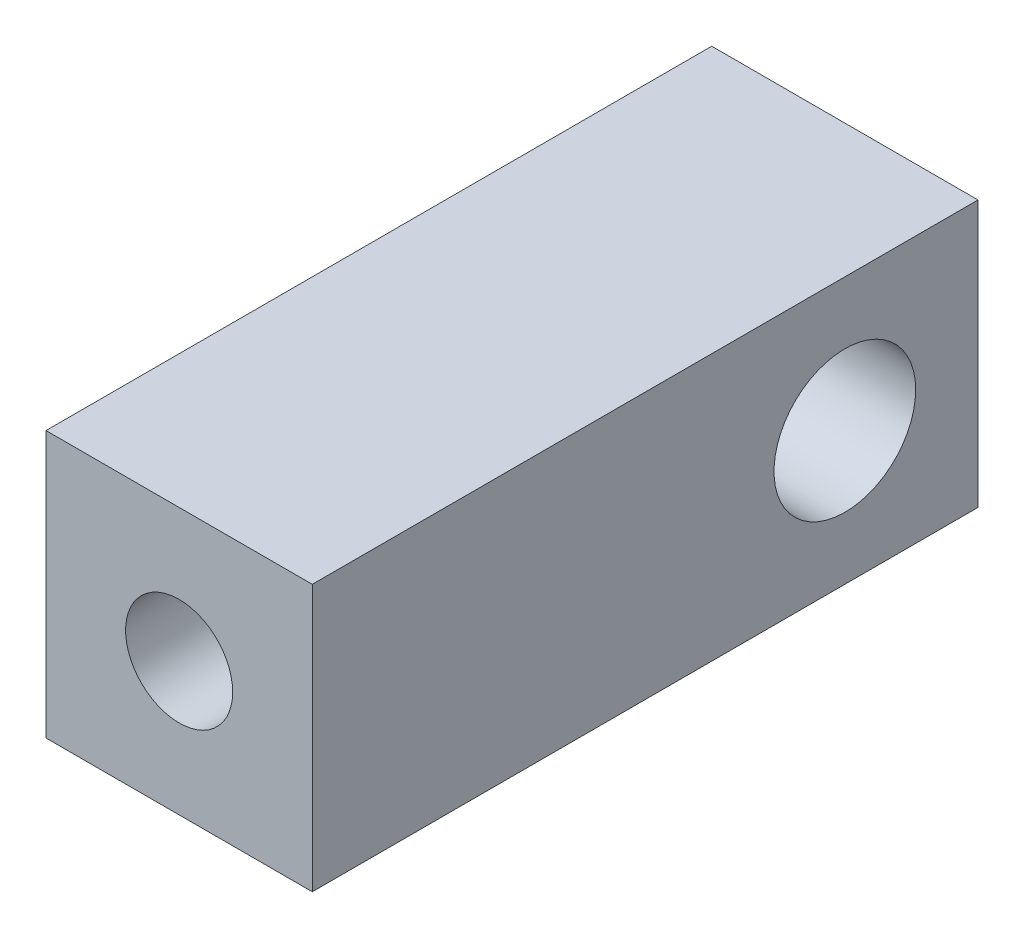
ISO-10303-21;
HEADER;
FILE_DESCRIPTION(('STEP AP214'),'2;1');
FILE_NAME('part.step','',(''),(''),'','','');
FILE_SCHEMA(('AUTOMOTIVE_DESIGN { 1 0 10303 214 1 1 1 1 }'));
ENDSEC;
DATA;
#1=APPLICATION_CONTEXT('core data for automotive mechanical design processes');
#2=APPLICATION_PROTOCOL_DEFINITION('international standard','automotive_design',2000,#1);
#3=PRODUCT_CONTEXT('',#1,'mechanical');
#4=PRODUCT('Part','Part','',(#3));
#5=PRODUCT_RELATED_PRODUCT_CATEGORY('part','',(#4));
#6=PRODUCT_DEFINITION_FORMATION('','',#4);
#7=PRODUCT_DEFINITION_CONTEXT('part definition',#1,'design');
#8=PRODUCT_DEFINITION('design','',#6,#7);
#9=PRODUCT_DEFINITION_SHAPE('','',#8);
#10=(LENGTH_UNIT() NAMED_UNIT(*) SI_UNIT(.MILLI.,.METRE.));
#11=(NAMED_UNIT(*) PLANE_ANGLE_UNIT() SI_UNIT($,.RADIAN.));
#12=(NAMED_UNIT(*) SI_UNIT($,.STERADIAN.) SOLID_ANGLE_UNIT());
#13=UNCERTAINTY_MEASURE_WITH_UNIT(LENGTH_MEASURE(1.E-05),#10,'distance_accuracy_value','');
#14=(GEOMETRIC_REPRESENTATION_CONTEXT(3) GLOBAL_UNCERTAINTY_ASSIGNED_CONTEXT((#13)) GLOBAL_UNIT_ASSIGNED_CONTEXT((#10,
#11,#12)) REPRESENTATION_CONTEXT('',''));
#15=CARTESIAN_POINT('',(0.,0.,0.));
#16=DIRECTION('',(0.,0.,1.));
#17=DIRECTION('',(1.,0.,0.));
#18=AXIS2_PLACEMENT_3D('',#15,#16,#17);
#19=CARTESIAN_POINT('',(12.7,0.,0.));
#20=DIRECTION('',(0.,0.,-1.));
#21=DIRECTION('',(-1.,0.,0.));
#22=AXIS2_PLACEMENT_3D('',#19,#20,#21);
#23=PLANE('',#22);
#24=CARTESIAN_POINT('',(6.35,6.35,0.));
#25=DIRECTION('',(0.,0.,1.));
#26=DIRECTION('',(1.,0.,0.));
#27=AXIS2_PLACEMENT_3D('',#24,#25,#26);
#28=CIRCLE('',#27,2.55269999999999);
#29=CARTESIAN_POINT('',(8.90269999999999,6.35,0.));
#30=VERTEX_POINT('',#29);
#31=EDGE_CURVE('E100',#30,#30,#28,.T.);
#32=ORIENTED_EDGE('',*,*,#31,.F.);
#33=EDGE_LOOP('',(#32));
#34=FACE_BOUND('',#33,.T.);
#35=DIRECTION('',(0.,-1.,0.));
#36=VECTOR('',#35,1.);
#37=CARTESIAN_POINT('',(0.,0.,0.));
#38=LINE('',#37,#36);
#39=CARTESIAN_POINT('',(0.,12.7,0.));
#40=VERTEX_POINT('',#39);
#41=CARTESIAN_POINT('',(0.,0.,0.));
#42=VERTEX_POINT('',#41);
#43=EDGE_CURVE('E99',#40,#42,#38,.T.);
#44=ORIENTED_EDGE('',*,*,#43,.T.);
#45=DIRECTION('',(-1.,0.,0.));
#46=VECTOR('',#45,1.);
#47=CARTESIAN_POINT('',(12.7,0.,0.));
#48=LINE('',#47,#46);
#49=CARTESIAN_POINT('',(12.7,0.,0.));
#50=VERTEX_POINT('',#49);
#51=EDGE_CURVE('E11',#50,#42,#48,.T.);
#52=ORIENTED_EDGE('',*,*,#51,.F.);
#53=DIRECTION('',(0.,-1.,0.));
#54=VECTOR('',#53,1.);
#55=CARTESIAN_POINT('',(12.7,0.,0.));
#56=LINE('',#55,#54);
#57=CARTESIAN_POINT('',(12.7,12.7,0.));
#58=VERTEX_POINT('',#57);
#59=EDGE_CURVE('E110',#58,#50,#56,.T.);
#60=ORIENTED_EDGE('',*,*,#59,.F.);
#61=DIRECTION('',(-1.,0.,0.));
#62=VECTOR('',#61,1.);
#63=CARTESIAN_POINT('',(12.7,12.7,0.));
#64=LINE('',#63,#62);
#65=EDGE_CURVE('E115',#58,#40,#64,.T.);
#66=ORIENTED_EDGE('',*,*,#65,.T.);
#67=EDGE_LOOP('',(#44,#52,#60,#66));
#68=FACE_BOUND('',#67,.T.);
#69=ADVANCED_FACE('F38',(#34,#68),#23,.F.);
#70=CARTESIAN_POINT('',(12.7,0.,0.));
#71=DIRECTION('',(0.,1.,0.));
#72=DIRECTION('',(0.,0.,1.));
#73=AXIS2_PLACEMENT_3D('',#70,#71,#72);
#74=PLANE('',#73);
#75=DIRECTION('',(0.,0.,-1.));
#76=VECTOR('',#75,1.);
#77=CARTESIAN_POINT('',(0.,0.,0.));
#78=LINE('',#77,#76);
#79=CARTESIAN_POINT('',(0.,0.,-31.75));
#80=VERTEX_POINT('',#79);
#81=EDGE_CURVE('E103',#42,#80,#78,.T.);
#82=ORIENTED_EDGE('',*,*,#81,.T.);
#83=DIRECTION('',(-1.,0.,0.));
#84=VECTOR('',#83,1.);
#85=CARTESIAN_POINT('',(12.7,0.,-31.75));
#86=LINE('',#85,#84);
#87=CARTESIAN_POINT('',(12.7,0.,-31.75));
#88=VERTEX_POINT('',#87);
#89=EDGE_CURVE('E46',#88,#80,#86,.T.);
#90=ORIENTED_EDGE('',*,*,#89,.F.);
#91=DIRECTION('',(0.,0.,-1.));
#92=VECTOR('',#91,1.);
#93=CARTESIAN_POINT('',(12.7,0.,0.));
#94=LINE('',#93,#92);
#95=EDGE_CURVE('E85',#50,#88,#94,.T.);
#96=ORIENTED_EDGE('',*,*,#95,.F.);
#97=ORIENTED_EDGE('',*,*,#51,.T.);
#98=EDGE_LOOP('',(#82,#90,#96,#97));
#99=FACE_BOUND('',#98,.T.);
#100=ADVANCED_FACE('F139',(#99),#74,.F.);
#101=CARTESIAN_POINT('',(12.7,0.,-31.75));
#102=DIRECTION('',(0.,0.,1.));
#103=DIRECTION('',(1.,0.,0.));
#104=AXIS2_PLACEMENT_3D('',#101,#102,#103);
#105=PLANE('',#104);
#106=DIRECTION('',(0.,1.,0.));
#107=VECTOR('',#106,1.);
#108=CARTESIAN_POINT('',(0.,0.,-31.75));
#109=LINE('',#108,#107);
#110=CARTESIAN_POINT('',(0.,12.7,-31.75));
#111=VERTEX_POINT('',#110);
#112=EDGE_CURVE('E72',#80,#111,#109,.T.);
#113=ORIENTED_EDGE('',*,*,#112,.T.);
#114=DIRECTION('',(-1.,0.,0.));
#115=VECTOR('',#114,1.);
#116=CARTESIAN_POINT('',(12.7,12.7,-31.75));
#117=LINE('',#116,#115);
#118=CARTESIAN_POINT('',(12.7,12.7,-31.75));
#119=VERTEX_POINT('',#118);
#120=EDGE_CURVE('E121',#119,#111,#117,.T.);
#121=ORIENTED_EDGE('',*,*,#120,.F.);
#122=DIRECTION('',(0.,1.,0.));
#123=VECTOR('',#122,1.);
#124=CARTESIAN_POINT('',(12.7,0.,-31.75));
#125=LINE('',#124,#123);
#126=EDGE_CURVE('E113',#88,#119,#125,.T.);
#127=ORIENTED_EDGE('',*,*,#126,.F.);
#128=ORIENTED_EDGE('',*,*,#89,.T.);
#129=EDGE_LOOP('',(#113,#121,#127,#128));
#130=FACE_BOUND('',#129,.T.);
#131=ADVANCED_FACE('F123',(#130),#105,.F.);
#132=CARTESIAN_POINT('',(12.7,12.7,0.));
#133=DIRECTION('',(0.,-1.,0.));
#134=DIRECTION('',(0.,0.,-1.));
#135=AXIS2_PLACEMENT_3D('',#132,#133,#134);
#136=PLANE('',#135);
#137=DIRECTION('',(0.,0.,1.));
#138=VECTOR('',#137,1.);
#139=CARTESIAN_POINT('',(0.,12.7,0.));
#140=LINE('',#139,#138);
#141=EDGE_CURVE('E78',#111,#40,#140,.T.);
#142=ORIENTED_EDGE('',*,*,#141,.T.);
#143=ORIENTED_EDGE('',*,*,#65,.F.);
#144=DIRECTION('',(0.,0.,1.));
#145=VECTOR('',#144,1.);
#146=CARTESIAN_POINT('',(12.7,12.7,0.));
#147=LINE('',#146,#145);
#148=EDGE_CURVE('E54',#119,#58,#147,.T.);
#149=ORIENTED_EDGE('',*,*,#148,.F.);
#150=ORIENTED_EDGE('',*,*,#120,.T.);
#151=EDGE_LOOP('',(#142,#143,#149,#150));
#152=FACE_BOUND('',#151,.T.);
#153=ADVANCED_FACE('F129',(#152),#136,.F.);
#154=CARTESIAN_POINT('',(12.7,0.,0.));
#155=DIRECTION('',(-1.,0.,0.));
#156=DIRECTION('',(0.,0.,1.));
#157=AXIS2_PLACEMENT_3D('',#154,#155,#156);
#158=PLANE('',#157);
#159=CARTESIAN_POINT('',(12.7,6.35,-25.4));
#160=DIRECTION('',(1.,0.,0.));
#161=DIRECTION('',(0.,0.,-1.));
#162=AXIS2_PLACEMENT_3D('',#159,#160,#161);
#163=CIRCLE('',#162,3.3782);
#164=CARTESIAN_POINT('',(12.7,6.35,-28.7782));
#165=VERTEX_POINT('',#164);
#166=EDGE_CURVE('E163',#165,#165,#163,.T.);
#167=ORIENTED_EDGE('',*,*,#166,.F.);
#168=EDGE_LOOP('',(#167));
#169=FACE_BOUND('',#168,.T.);
#170=ORIENTED_EDGE('',*,*,#59,.T.);
#171=ORIENTED_EDGE('',*,*,#95,.T.);
#172=ORIENTED_EDGE('',*,*,#126,.T.);
#173=ORIENTED_EDGE('',*,*,#148,.T.);
#174=EDGE_LOOP('',(#170,#171,#172,#173));
#175=FACE_BOUND('',#174,.T.);
#176=ADVANCED_FACE('F131',(#169,#175),#158,.F.);
#177=CARTESIAN_POINT('',(0.,0.,0.));
#178=DIRECTION('',(-1.,0.,0.));
#179=DIRECTION('',(0.,0.,1.));
#180=AXIS2_PLACEMENT_3D('',#177,#178,#179);
#181=PLANE('',#180);
#182=CARTESIAN_POINT('',(0.,6.35,-25.4));
#183=DIRECTION('',(1.,0.,0.));
#184=DIRECTION('',(0.,0.,-1.));
#185=AXIS2_PLACEMENT_3D('',#182,#183,#184);
#186=CIRCLE('',#185,3.3782);
#187=CARTESIAN_POINT('',(0.,6.35,-28.7782));
#188=VERTEX_POINT('',#187);
#189=EDGE_CURVE('E106',#188,#188,#186,.T.);
#190=ORIENTED_EDGE('',*,*,#189,.T.);
#191=EDGE_LOOP('',(#190));
#192=FACE_BOUND('',#191,.T.);
#193=ORIENTED_EDGE('',*,*,#43,.F.);
#194=ORIENTED_EDGE('',*,*,#141,.F.);
#195=ORIENTED_EDGE('',*,*,#112,.F.);
#196=ORIENTED_EDGE('',*,*,#81,.F.);
#197=EDGE_LOOP('',(#193,#194,#195,#196));
#198=FACE_BOUND('',#197,.T.);
#199=ADVANCED_FACE('F93',(#192,#198),#181,.T.);
#200=CARTESIAN_POINT('',(6.35,6.35,-16.51));
#201=DIRECTION('',(0.,0.,1.));
#202=DIRECTION('',(1.,0.,0.));
#203=AXIS2_PLACEMENT_3D('',#200,#201,#202);
#204=CONICAL_SURFACE('',#203,2.55269999999999,1.02974425867665);
#205=CARTESIAN_POINT('',(6.35,6.35,-18.0438169021917));
#206=VERTEX_POINT('',#205);
#207=VERTEX_LOOP('',#206);
#208=FACE_BOUND('',#207,.T.);
#209=CARTESIAN_POINT('',(6.35,6.35,-16.51));
#210=DIRECTION('',(0.,0.,1.));
#211=DIRECTION('',(1.,0.,0.));
#212=AXIS2_PLACEMENT_3D('',#209,#210,#211);
#213=CIRCLE('',#212,2.55269999999999);
#214=CARTESIAN_POINT('',(8.90269999999999,6.35,-16.51));
#215=VERTEX_POINT('',#214);
#216=EDGE_CURVE('E97',#215,#215,#213,.T.);
#217=ORIENTED_EDGE('',*,*,#216,.T.);
#218=EDGE_LOOP('',(#217));
#219=FACE_BOUND('',#218,.T.);
#220=ADVANCED_FACE('F89',(#208,#219),#204,.F.);
#221=CARTESIAN_POINT('',(6.35,6.35,0.));
#222=DIRECTION('',(0.,0.,1.));
#223=DIRECTION('',(1.,0.,0.));
#224=AXIS2_PLACEMENT_3D('',#221,#222,#223);
#225=CYLINDRICAL_SURFACE('',#224,2.55269999999999);
#226=ORIENTED_EDGE('',*,*,#216,.F.);
#227=EDGE_LOOP('',(#226));
#228=FACE_BOUND('',#227,.T.);
#229=ORIENTED_EDGE('',*,*,#31,.T.);
#230=EDGE_LOOP('',(#229));
#231=FACE_BOUND('',#230,.T.);
#232=ADVANCED_FACE('F92',(#228,#231),#225,.F.);
#233=CARTESIAN_POINT('',(0.,6.35,-25.4));
#234=DIRECTION('',(1.,0.,0.));
#235=DIRECTION('',(0.,0.,-1.));
#236=AXIS2_PLACEMENT_3D('',#233,#234,#235);
#237=CYLINDRICAL_SURFACE('',#236,3.3782);
#238=ORIENTED_EDGE('',*,*,#189,.F.);
#239=EDGE_LOOP('',(#238));
#240=FACE_BOUND('',#239,.T.);
#241=ORIENTED_EDGE('',*,*,#166,.T.);
#242=EDGE_LOOP('',(#241));
#243=FACE_BOUND('',#242,.T.);
#244=ADVANCED_FACE('F150',(#240,#243),#237,.F.);
#245=CLOSED_SHELL('',(#69,#100,#131,#153,#176,#199,#220,#232,#244));
#246=MANIFOLD_SOLID_BREP('B2',#245);
#247=ADVANCED_BREP_SHAPE_REPRESENTATION('',(#18,#246),#14);
#248=SHAPE_DEFINITION_REPRESENTATION(#9,#247);
ENDSEC;
END-ISO-10303-21;
